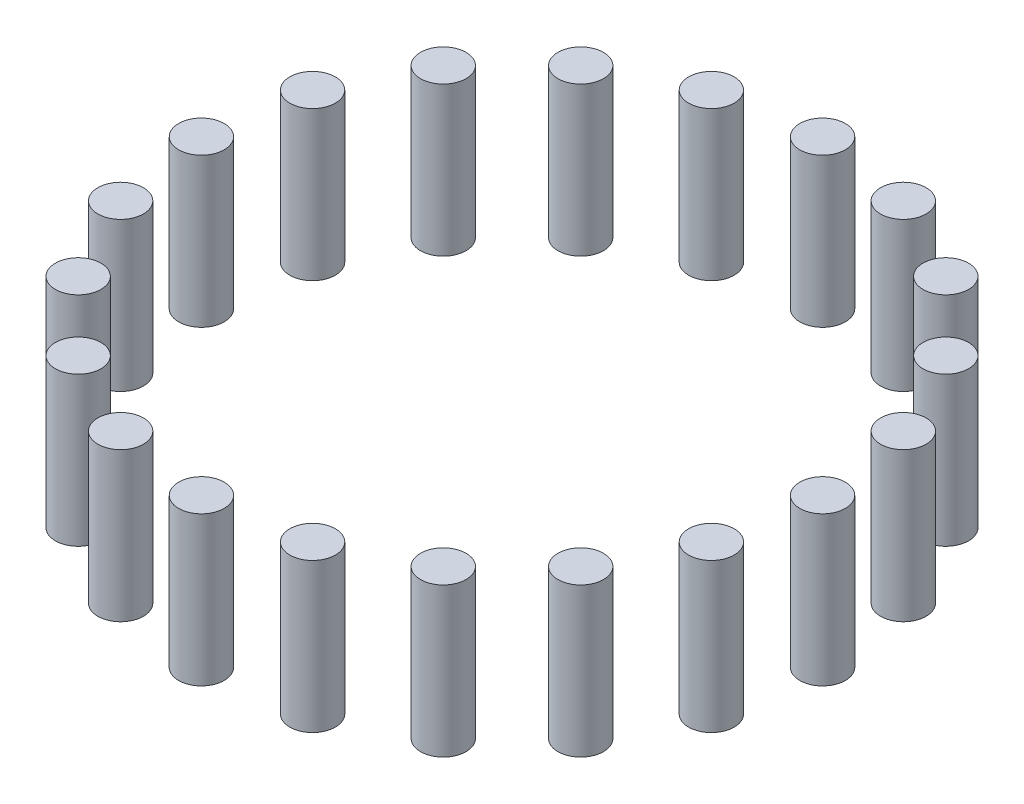
ISO-10303-21;
HEADER;
FILE_DESCRIPTION(('STEP AP214'),'2;1');
FILE_NAME('part.step','',(''),(''),'','','');
FILE_SCHEMA(('AUTOMOTIVE_DESIGN { 1 0 10303 214 1 1 1 1 }'));
ENDSEC;
DATA;
#1=APPLICATION_CONTEXT('core data for automotive mechanical design processes');
#2=APPLICATION_PROTOCOL_DEFINITION('international standard','automotive_design',2000,#1);
#3=PRODUCT_CONTEXT('',#1,'mechanical');
#4=PRODUCT('Part','Part','',(#3));
#5=PRODUCT_RELATED_PRODUCT_CATEGORY('part','',(#4));
#6=PRODUCT_DEFINITION_FORMATION('','',#4);
#7=PRODUCT_DEFINITION_CONTEXT('part definition',#1,'design');
#8=PRODUCT_DEFINITION('design','',#6,#7);
#9=PRODUCT_DEFINITION_SHAPE('','',#8);
#10=(LENGTH_UNIT() NAMED_UNIT(*) SI_UNIT(.MILLI.,.METRE.));
#11=(NAMED_UNIT(*) PLANE_ANGLE_UNIT() SI_UNIT($,.RADIAN.));
#12=(NAMED_UNIT(*) SI_UNIT($,.STERADIAN.) SOLID_ANGLE_UNIT());
#13=UNCERTAINTY_MEASURE_WITH_UNIT(LENGTH_MEASURE(1.E-05),#10,'distance_accuracy_value','');
#14=(GEOMETRIC_REPRESENTATION_CONTEXT(3) GLOBAL_UNCERTAINTY_ASSIGNED_CONTEXT((#13)) GLOBAL_UNIT_ASSIGNED_CONTEXT((#10,
#11,#12)) REPRESENTATION_CONTEXT('',''));
#15=CARTESIAN_POINT('',(0.,0.,0.));
#16=DIRECTION('',(0.,0.,1.));
#17=DIRECTION('',(1.,0.,0.));
#18=AXIS2_PLACEMENT_3D('',#15,#16,#17);
#19=CARTESIAN_POINT('',(23.1762745781199,36.,71.3292387221369));
#20=DIRECTION('',(0.,-1.,0.));
#21=DIRECTION('',(0.,0.,-1.));
#22=AXIS2_PLACEMENT_3D('',#19,#20,#21);
#23=CYLINDRICAL_SURFACE('',#22,5.50000000000001);
#24=CARTESIAN_POINT('',(23.1762745781199,36.,71.3292387221369));
#25=DIRECTION('',(0.,1.,0.));
#26=DIRECTION('',(0.,0.,1.));
#27=AXIS2_PLACEMENT_3D('',#24,#25,#26);
#28=CIRCLE('',#27,5.50000000000001);
#29=CARTESIAN_POINT('',(23.1762745781199,36.,76.8292387221369));
#30=VERTEX_POINT('',#29);
#31=EDGE_CURVE('E50',#30,#30,#28,.T.);
#32=ORIENTED_EDGE('',*,*,#31,.F.);
#33=EDGE_LOOP('',(#32));
#34=FACE_BOUND('',#33,.T.);
#35=CARTESIAN_POINT('',(23.1762745781199,0.,71.3292387221369));
#36=DIRECTION('',(0.,1.,0.));
#37=DIRECTION('',(0.,0.,1.));
#38=AXIS2_PLACEMENT_3D('',#35,#36,#37);
#39=CIRCLE('',#38,5.50000000000001);
#40=CARTESIAN_POINT('',(23.1762745781199,0.,76.8292387221369));
#41=VERTEX_POINT('',#40);
#42=EDGE_CURVE('E11',#41,#41,#39,.T.);
#43=ORIENTED_EDGE('',*,*,#42,.T.);
#44=EDGE_LOOP('',(#43));
#45=FACE_BOUND('',#44,.T.);
#46=ADVANCED_FACE('F46',(#34,#45),#23,.T.);
#47=CARTESIAN_POINT('',(23.1762745781199,36.,71.3292387221369));
#48=DIRECTION('',(0.,1.,0.));
#49=DIRECTION('',(0.,0.,1.));
#50=AXIS2_PLACEMENT_3D('',#47,#48,#49);
#51=PLANE('',#50);
#52=ORIENTED_EDGE('',*,*,#31,.T.);
#53=EDGE_LOOP('',(#52));
#54=FACE_BOUND('',#53,.T.);
#55=ADVANCED_FACE('F48',(#54),#51,.T.);
#56=CARTESIAN_POINT('',(23.1762745781199,0.,71.3292387221369));
#57=DIRECTION('',(0.,1.,0.));
#58=DIRECTION('',(0.,0.,1.));
#59=AXIS2_PLACEMENT_3D('',#56,#57,#58);
#60=PLANE('',#59);
#61=ORIENTED_EDGE('',*,*,#42,.F.);
#62=EDGE_LOOP('',(#61));
#63=FACE_BOUND('',#62,.T.);
#64=ADVANCED_FACE('F65',(#63),#60,.F.);
#65=CLOSED_SHELL('',(#46,#55,#64));
#66=MANIFOLD_SOLID_BREP('B2',#65);
#67=CARTESIAN_POINT('',(44.0838939219345,36.,60.6762745781218));
#68=DIRECTION('',(0.,-1.,0.));
#69=DIRECTION('',(0.,0.,-1.));
#70=AXIS2_PLACEMENT_3D('',#67,#68,#69);
#71=CYLINDRICAL_SURFACE('',#70,5.49999999999999);
#72=CARTESIAN_POINT('',(44.0838939219345,36.,60.6762745781218));
#73=DIRECTION('',(0.,1.,0.));
#74=DIRECTION('',(0.,0.,1.));
#75=AXIS2_PLACEMENT_3D('',#72,#73,#74);
#76=CIRCLE('',#75,5.49999999999999);
#77=CARTESIAN_POINT('',(44.0838939219345,36.,66.1762745781218));
#78=VERTEX_POINT('',#77);
#79=EDGE_CURVE('E105',#78,#78,#76,.T.);
#80=ORIENTED_EDGE('',*,*,#79,.F.);
#81=EDGE_LOOP('',(#80));
#82=FACE_BOUND('',#81,.T.);
#83=CARTESIAN_POINT('',(44.0838939219345,0.,60.6762745781218));
#84=DIRECTION('',(0.,1.,0.));
#85=DIRECTION('',(0.,0.,1.));
#86=AXIS2_PLACEMENT_3D('',#83,#84,#85);
#87=CIRCLE('',#86,5.49999999999999);
#88=CARTESIAN_POINT('',(44.0838939219345,0.,66.1762745781218));
#89=VERTEX_POINT('',#88);
#90=EDGE_CURVE('E45',#89,#89,#87,.T.);
#91=ORIENTED_EDGE('',*,*,#90,.T.);
#92=EDGE_LOOP('',(#91));
#93=FACE_BOUND('',#92,.T.);
#94=ADVANCED_FACE('F101',(#82,#93),#71,.T.);
#95=CARTESIAN_POINT('',(44.0838939219345,36.,60.6762745781218));
#96=DIRECTION('',(0.,1.,0.));
#97=DIRECTION('',(0.,0.,1.));
#98=AXIS2_PLACEMENT_3D('',#95,#96,#97);
#99=PLANE('',#98);
#100=ORIENTED_EDGE('',*,*,#79,.T.);
#101=EDGE_LOOP('',(#100));
#102=FACE_BOUND('',#101,.T.);
#103=ADVANCED_FACE('F103',(#102),#99,.T.);
#104=CARTESIAN_POINT('',(44.0838939219345,0.,60.6762745781218));
#105=DIRECTION('',(0.,1.,0.));
#106=DIRECTION('',(0.,0.,1.));
#107=AXIS2_PLACEMENT_3D('',#104,#105,#106);
#108=PLANE('',#107);
#109=ORIENTED_EDGE('',*,*,#90,.F.);
#110=EDGE_LOOP('',(#109));
#111=FACE_BOUND('',#110,.T.);
#112=ADVANCED_FACE('F120',(#111),#108,.F.);
#113=CLOSED_SHELL('',(#94,#103,#112));
#114=MANIFOLD_SOLID_BREP('B6',#113);
#115=CARTESIAN_POINT('',(60.6762745781204,36.,44.0838939219364));
#116=DIRECTION('',(0.,-1.,0.));
#117=DIRECTION('',(0.,0.,-1.));
#118=AXIS2_PLACEMENT_3D('',#115,#116,#117);
#119=CYLINDRICAL_SURFACE('',#118,5.50000000000001);
#120=CARTESIAN_POINT('',(60.6762745781204,36.,44.0838939219364));
#121=DIRECTION('',(0.,1.,0.));
#122=DIRECTION('',(0.,0.,1.));
#123=AXIS2_PLACEMENT_3D('',#120,#121,#122);
#124=CIRCLE('',#123,5.50000000000001);
#125=CARTESIAN_POINT('',(60.6762745781204,36.,49.5838939219364));
#126=VERTEX_POINT('',#125);
#127=EDGE_CURVE('E160',#126,#126,#124,.T.);
#128=ORIENTED_EDGE('',*,*,#127,.F.);
#129=EDGE_LOOP('',(#128));
#130=FACE_BOUND('',#129,.T.);
#131=CARTESIAN_POINT('',(60.6762745781204,0.,44.0838939219364));
#132=DIRECTION('',(0.,1.,0.));
#133=DIRECTION('',(0.,0.,1.));
#134=AXIS2_PLACEMENT_3D('',#131,#132,#133);
#135=CIRCLE('',#134,5.50000000000001);
#136=CARTESIAN_POINT('',(60.6762745781204,0.,49.5838939219364));
#137=VERTEX_POINT('',#136);
#138=EDGE_CURVE('E100',#137,#137,#135,.T.);
#139=ORIENTED_EDGE('',*,*,#138,.T.);
#140=EDGE_LOOP('',(#139));
#141=FACE_BOUND('',#140,.T.);
#142=ADVANCED_FACE('F156',(#130,#141),#119,.T.);
#143=CARTESIAN_POINT('',(60.6762745781204,36.,44.0838939219364));
#144=DIRECTION('',(0.,1.,0.));
#145=DIRECTION('',(0.,0.,1.));
#146=AXIS2_PLACEMENT_3D('',#143,#144,#145);
#147=PLANE('',#146);
#148=ORIENTED_EDGE('',*,*,#127,.T.);
#149=EDGE_LOOP('',(#148));
#150=FACE_BOUND('',#149,.T.);
#151=ADVANCED_FACE('F158',(#150),#147,.T.);
#152=CARTESIAN_POINT('',(60.6762745781204,0.,44.0838939219364));
#153=DIRECTION('',(0.,1.,0.));
#154=DIRECTION('',(0.,0.,1.));
#155=AXIS2_PLACEMENT_3D('',#152,#153,#154);
#156=PLANE('',#155);
#157=ORIENTED_EDGE('',*,*,#138,.F.);
#158=EDGE_LOOP('',(#157));
#159=FACE_BOUND('',#158,.T.);
#160=ADVANCED_FACE('F175',(#159),#156,.F.);
#161=CLOSED_SHELL('',(#142,#151,#160));
#162=MANIFOLD_SOLID_BREP('B40',#161);
#163=CARTESIAN_POINT('',(71.3292387221362,36.,23.1762745781221));
#164=DIRECTION('',(0.,-1.,0.));
#165=DIRECTION('',(0.,0.,-1.));
#166=AXIS2_PLACEMENT_3D('',#163,#164,#165);
#167=CYLINDRICAL_SURFACE('',#166,5.50000000000001);
#168=CARTESIAN_POINT('',(71.3292387221362,36.,23.1762745781221));
#169=DIRECTION('',(0.,1.,0.));
#170=DIRECTION('',(0.,0.,1.));
#171=AXIS2_PLACEMENT_3D('',#168,#169,#170);
#172=CIRCLE('',#171,5.50000000000001);
#173=CARTESIAN_POINT('',(71.3292387221362,36.,28.6762745781221));
#174=VERTEX_POINT('',#173);
#175=EDGE_CURVE('E215',#174,#174,#172,.T.);
#176=ORIENTED_EDGE('',*,*,#175,.F.);
#177=EDGE_LOOP('',(#176));
#178=FACE_BOUND('',#177,.T.);
#179=CARTESIAN_POINT('',(71.3292387221362,0.,23.1762745781221));
#180=DIRECTION('',(0.,1.,0.));
#181=DIRECTION('',(0.,0.,1.));
#182=AXIS2_PLACEMENT_3D('',#179,#180,#181);
#183=CIRCLE('',#182,5.50000000000001);
#184=CARTESIAN_POINT('',(71.3292387221362,0.,28.6762745781221));
#185=VERTEX_POINT('',#184);
#186=EDGE_CURVE('E155',#185,#185,#183,.T.);
#187=ORIENTED_EDGE('',*,*,#186,.T.);
#188=EDGE_LOOP('',(#187));
#189=FACE_BOUND('',#188,.T.);
#190=ADVANCED_FACE('F211',(#178,#189),#167,.T.);
#191=CARTESIAN_POINT('',(71.3292387221362,36.,23.1762745781221));
#192=DIRECTION('',(0.,1.,0.));
#193=DIRECTION('',(0.,0.,1.));
#194=AXIS2_PLACEMENT_3D('',#191,#192,#193);
#195=PLANE('',#194);
#196=ORIENTED_EDGE('',*,*,#175,.T.);
#197=EDGE_LOOP('',(#196));
#198=FACE_BOUND('',#197,.T.);
#199=ADVANCED_FACE('F213',(#198),#195,.T.);
#200=CARTESIAN_POINT('',(71.3292387221362,0.,23.1762745781221));
#201=DIRECTION('',(0.,1.,0.));
#202=DIRECTION('',(0.,0.,1.));
#203=AXIS2_PLACEMENT_3D('',#200,#201,#202);
#204=PLANE('',#203);
#205=ORIENTED_EDGE('',*,*,#186,.F.);
#206=EDGE_LOOP('',(#205));
#207=FACE_BOUND('',#206,.T.);
#208=ADVANCED_FACE('F230',(#207),#204,.F.);
#209=CLOSED_SHELL('',(#190,#199,#208));
#210=MANIFOLD_SOLID_BREP('B95',#209);
#211=CARTESIAN_POINT('',(75.,36.,0.));
#212=DIRECTION('',(0.,-1.,0.));
#213=DIRECTION('',(0.,0.,-1.));
#214=AXIS2_PLACEMENT_3D('',#211,#212,#213);
#215=CYLINDRICAL_SURFACE('',#214,5.5);
#216=CARTESIAN_POINT('',(75.,36.,0.));
#217=DIRECTION('',(0.,1.,0.));
#218=DIRECTION('',(0.,0.,1.));
#219=AXIS2_PLACEMENT_3D('',#216,#217,#218);
#220=CIRCLE('',#219,5.5);
#221=CARTESIAN_POINT('',(75.,36.,5.5));
#222=VERTEX_POINT('',#221);
#223=EDGE_CURVE('E270',#222,#222,#220,.T.);
#224=ORIENTED_EDGE('',*,*,#223,.F.);
#225=EDGE_LOOP('',(#224));
#226=FACE_BOUND('',#225,.T.);
#227=CARTESIAN_POINT('',(75.,0.,0.));
#228=DIRECTION('',(0.,1.,0.));
#229=DIRECTION('',(0.,0.,1.));
#230=AXIS2_PLACEMENT_3D('',#227,#228,#229);
#231=CIRCLE('',#230,5.5);
#232=CARTESIAN_POINT('',(75.,0.,5.5));
#233=VERTEX_POINT('',#232);
#234=EDGE_CURVE('E210',#233,#233,#231,.T.);
#235=ORIENTED_EDGE('',*,*,#234,.T.);
#236=EDGE_LOOP('',(#235));
#237=FACE_BOUND('',#236,.T.);
#238=ADVANCED_FACE('F266',(#226,#237),#215,.T.);
#239=CARTESIAN_POINT('',(75.,36.,0.));
#240=DIRECTION('',(0.,1.,0.));
#241=DIRECTION('',(0.,0.,1.));
#242=AXIS2_PLACEMENT_3D('',#239,#240,#241);
#243=PLANE('',#242);
#244=ORIENTED_EDGE('',*,*,#223,.T.);
#245=EDGE_LOOP('',(#244));
#246=FACE_BOUND('',#245,.T.);
#247=ADVANCED_FACE('F268',(#246),#243,.T.);
#248=CARTESIAN_POINT('',(75.,0.,0.));
#249=DIRECTION('',(0.,1.,0.));
#250=DIRECTION('',(0.,0.,1.));
#251=AXIS2_PLACEMENT_3D('',#248,#249,#250);
#252=PLANE('',#251);
#253=ORIENTED_EDGE('',*,*,#234,.F.);
#254=EDGE_LOOP('',(#253));
#255=FACE_BOUND('',#254,.T.);
#256=ADVANCED_FACE('F285',(#255),#252,.F.);
#257=CLOSED_SHELL('',(#238,#247,#256));
#258=MANIFOLD_SOLID_BREP('B150',#257);
#259=CARTESIAN_POINT('',(-1.33486971476415E-12,36.,75.));
#260=DIRECTION('',(0.,-1.,0.));
#261=DIRECTION('',(0.,0.,-1.));
#262=AXIS2_PLACEMENT_3D('',#259,#260,#261);
#263=CYLINDRICAL_SURFACE('',#262,5.50000000000002);
#264=CARTESIAN_POINT('',(-1.33486971476415E-12,36.,75.));
#265=DIRECTION('',(0.,1.,0.));
#266=DIRECTION('',(0.,0.,1.));
#267=AXIS2_PLACEMENT_3D('',#264,#265,#266);
#268=CIRCLE('',#267,5.50000000000002);
#269=CARTESIAN_POINT('',(-1.33486971476415E-12,36.,80.5));
#270=VERTEX_POINT('',#269);
#271=EDGE_CURVE('E325',#270,#270,#268,.T.);
#272=ORIENTED_EDGE('',*,*,#271,.F.);
#273=EDGE_LOOP('',(#272));
#274=FACE_BOUND('',#273,.T.);
#275=CARTESIAN_POINT('',(-1.33486971476415E-12,0.,75.));
#276=DIRECTION('',(0.,1.,0.));
#277=DIRECTION('',(0.,0.,1.));
#278=AXIS2_PLACEMENT_3D('',#275,#276,#277);
#279=CIRCLE('',#278,5.50000000000002);
#280=CARTESIAN_POINT('',(-1.33486971476415E-12,0.,80.5));
#281=VERTEX_POINT('',#280);
#282=EDGE_CURVE('E265',#281,#281,#279,.T.);
#283=ORIENTED_EDGE('',*,*,#282,.T.);
#284=EDGE_LOOP('',(#283));
#285=FACE_BOUND('',#284,.T.);
#286=ADVANCED_FACE('F321',(#274,#285),#263,.T.);
#287=CARTESIAN_POINT('',(-1.33486971476415E-12,36.,75.));
#288=DIRECTION('',(0.,1.,0.));
#289=DIRECTION('',(0.,0.,1.));
#290=AXIS2_PLACEMENT_3D('',#287,#288,#289);
#291=PLANE('',#290);
#292=ORIENTED_EDGE('',*,*,#271,.T.);
#293=EDGE_LOOP('',(#292));
#294=FACE_BOUND('',#293,.T.);
#295=ADVANCED_FACE('F323',(#294),#291,.T.);
#296=CARTESIAN_POINT('',(-1.33486971476415E-12,0.,75.));
#297=DIRECTION('',(0.,1.,0.));
#298=DIRECTION('',(0.,0.,1.));
#299=AXIS2_PLACEMENT_3D('',#296,#297,#298);
#300=PLANE('',#299);
#301=ORIENTED_EDGE('',*,*,#282,.F.);
#302=EDGE_LOOP('',(#301));
#303=FACE_BOUND('',#302,.T.);
#304=ADVANCED_FACE('F340',(#303),#300,.F.);
#305=CLOSED_SHELL('',(#286,#295,#304));
#306=MANIFOLD_SOLID_BREP('B205',#305);
#307=CARTESIAN_POINT('',(-23.1762745781224,36.,71.3292387221361));
#308=DIRECTION('',(0.,-1.,0.));
#309=DIRECTION('',(0.,0.,-1.));
#310=AXIS2_PLACEMENT_3D('',#307,#308,#309);
#311=CYLINDRICAL_SURFACE('',#310,5.50000000000002);
#312=CARTESIAN_POINT('',(-23.1762745781224,36.,71.3292387221361));
#313=DIRECTION('',(0.,1.,0.));
#314=DIRECTION('',(0.,0.,1.));
#315=AXIS2_PLACEMENT_3D('',#312,#313,#314);
#316=CIRCLE('',#315,5.50000000000002);
#317=CARTESIAN_POINT('',(-23.1762745781224,36.,76.8292387221361));
#318=VERTEX_POINT('',#317);
#319=EDGE_CURVE('E380',#318,#318,#316,.T.);
#320=ORIENTED_EDGE('',*,*,#319,.F.);
#321=EDGE_LOOP('',(#320));
#322=FACE_BOUND('',#321,.T.);
#323=CARTESIAN_POINT('',(-23.1762745781224,0.,71.3292387221361));
#324=DIRECTION('',(0.,1.,0.));
#325=DIRECTION('',(0.,0.,1.));
#326=AXIS2_PLACEMENT_3D('',#323,#324,#325);
#327=CIRCLE('',#326,5.50000000000002);
#328=CARTESIAN_POINT('',(-23.1762745781224,0.,76.8292387221361));
#329=VERTEX_POINT('',#328);
#330=EDGE_CURVE('E320',#329,#329,#327,.T.);
#331=ORIENTED_EDGE('',*,*,#330,.T.);
#332=EDGE_LOOP('',(#331));
#333=FACE_BOUND('',#332,.T.);
#334=ADVANCED_FACE('F376',(#322,#333),#311,.T.);
#335=CARTESIAN_POINT('',(-23.1762745781224,36.,71.3292387221361));
#336=DIRECTION('',(0.,1.,0.));
#337=DIRECTION('',(0.,0.,1.));
#338=AXIS2_PLACEMENT_3D('',#335,#336,#337);
#339=PLANE('',#338);
#340=ORIENTED_EDGE('',*,*,#319,.T.);
#341=EDGE_LOOP('',(#340));
#342=FACE_BOUND('',#341,.T.);
#343=ADVANCED_FACE('F378',(#342),#339,.T.);
#344=CARTESIAN_POINT('',(-23.1762745781224,0.,71.3292387221361));
#345=DIRECTION('',(0.,1.,0.));
#346=DIRECTION('',(0.,0.,1.));
#347=AXIS2_PLACEMENT_3D('',#344,#345,#346);
#348=PLANE('',#347);
#349=ORIENTED_EDGE('',*,*,#330,.F.);
#350=EDGE_LOOP('',(#349));
#351=FACE_BOUND('',#350,.T.);
#352=ADVANCED_FACE('F395',(#351),#348,.F.);
#353=CLOSED_SHELL('',(#334,#343,#352));
#354=MANIFOLD_SOLID_BREP('B260',#353);
#355=CARTESIAN_POINT('',(-44.0838939219366,36.,60.6762745781202));
#356=DIRECTION('',(0.,-1.,0.));
#357=DIRECTION('',(0.,0.,-1.));
#358=AXIS2_PLACEMENT_3D('',#355,#356,#357);
#359=CYLINDRICAL_SURFACE('',#358,5.50000000000001);
#360=CARTESIAN_POINT('',(-44.0838939219366,36.,60.6762745781202));
#361=DIRECTION('',(0.,1.,0.));
#362=DIRECTION('',(0.,0.,1.));
#363=AXIS2_PLACEMENT_3D('',#360,#361,#362);
#364=CIRCLE('',#363,5.50000000000001);
#365=CARTESIAN_POINT('',(-44.0838939219366,36.,66.1762745781202));
#366=VERTEX_POINT('',#365);
#367=EDGE_CURVE('E435',#366,#366,#364,.T.);
#368=ORIENTED_EDGE('',*,*,#367,.F.);
#369=EDGE_LOOP('',(#368));
#370=FACE_BOUND('',#369,.T.);
#371=CARTESIAN_POINT('',(-44.0838939219366,0.,60.6762745781202));
#372=DIRECTION('',(0.,1.,0.));
#373=DIRECTION('',(0.,0.,1.));
#374=AXIS2_PLACEMENT_3D('',#371,#372,#373);
#375=CIRCLE('',#374,5.50000000000001);
#376=CARTESIAN_POINT('',(-44.0838939219366,0.,66.1762745781202));
#377=VERTEX_POINT('',#376);
#378=EDGE_CURVE('E375',#377,#377,#375,.T.);
#379=ORIENTED_EDGE('',*,*,#378,.T.);
#380=EDGE_LOOP('',(#379));
#381=FACE_BOUND('',#380,.T.);
#382=ADVANCED_FACE('F431',(#370,#381),#359,.T.);
#383=CARTESIAN_POINT('',(-44.0838939219366,36.,60.6762745781202));
#384=DIRECTION('',(0.,1.,0.));
#385=DIRECTION('',(0.,0.,1.));
#386=AXIS2_PLACEMENT_3D('',#383,#384,#385);
#387=PLANE('',#386);
#388=ORIENTED_EDGE('',*,*,#367,.T.);
#389=EDGE_LOOP('',(#388));
#390=FACE_BOUND('',#389,.T.);
#391=ADVANCED_FACE('F433',(#390),#387,.T.);
#392=CARTESIAN_POINT('',(-44.0838939219366,0.,60.6762745781202));
#393=DIRECTION('',(0.,1.,0.));
#394=DIRECTION('',(0.,0.,1.));
#395=AXIS2_PLACEMENT_3D('',#392,#393,#394);
#396=PLANE('',#395);
#397=ORIENTED_EDGE('',*,*,#378,.F.);
#398=EDGE_LOOP('',(#397));
#399=FACE_BOUND('',#398,.T.);
#400=ADVANCED_FACE('F450',(#399),#396,.F.);
#401=CLOSED_SHELL('',(#382,#391,#400));
#402=MANIFOLD_SOLID_BREP('B315',#401);
#403=CARTESIAN_POINT('',(-60.676274578122,36.,44.0838939219343));
#404=DIRECTION('',(0.,-1.,0.));
#405=DIRECTION('',(0.,0.,-1.));
#406=AXIS2_PLACEMENT_3D('',#403,#404,#405);
#407=CYLINDRICAL_SURFACE('',#406,5.50000000000001);
#408=CARTESIAN_POINT('',(-60.676274578122,36.,44.0838939219343));
#409=DIRECTION('',(0.,1.,0.));
#410=DIRECTION('',(0.,0.,1.));
#411=AXIS2_PLACEMENT_3D('',#408,#409,#410);
#412=CIRCLE('',#411,5.50000000000001);
#413=CARTESIAN_POINT('',(-60.676274578122,36.,49.5838939219343));
#414=VERTEX_POINT('',#413);
#415=EDGE_CURVE('E490',#414,#414,#412,.T.);
#416=ORIENTED_EDGE('',*,*,#415,.F.);
#417=EDGE_LOOP('',(#416));
#418=FACE_BOUND('',#417,.T.);
#419=CARTESIAN_POINT('',(-60.676274578122,0.,44.0838939219343));
#420=DIRECTION('',(0.,1.,0.));
#421=DIRECTION('',(0.,0.,1.));
#422=AXIS2_PLACEMENT_3D('',#419,#420,#421);
#423=CIRCLE('',#422,5.50000000000001);
#424=CARTESIAN_POINT('',(-60.676274578122,0.,49.5838939219343));
#425=VERTEX_POINT('',#424);
#426=EDGE_CURVE('E430',#425,#425,#423,.T.);
#427=ORIENTED_EDGE('',*,*,#426,.T.);
#428=EDGE_LOOP('',(#427));
#429=FACE_BOUND('',#428,.T.);
#430=ADVANCED_FACE('F486',(#418,#429),#407,.T.);
#431=CARTESIAN_POINT('',(-60.676274578122,36.,44.0838939219343));
#432=DIRECTION('',(0.,1.,0.));
#433=DIRECTION('',(0.,0.,1.));
#434=AXIS2_PLACEMENT_3D('',#431,#432,#433);
#435=PLANE('',#434);
#436=ORIENTED_EDGE('',*,*,#415,.T.);
#437=EDGE_LOOP('',(#436));
#438=FACE_BOUND('',#437,.T.);
#439=ADVANCED_FACE('F488',(#438),#435,.T.);
#440=CARTESIAN_POINT('',(-60.676274578122,0.,44.0838939219343));
#441=DIRECTION('',(0.,1.,0.));
#442=DIRECTION('',(0.,0.,1.));
#443=AXIS2_PLACEMENT_3D('',#440,#441,#442);
#444=PLANE('',#443);
#445=ORIENTED_EDGE('',*,*,#426,.F.);
#446=EDGE_LOOP('',(#445));
#447=FACE_BOUND('',#446,.T.);
#448=ADVANCED_FACE('F505',(#447),#444,.F.);
#449=CLOSED_SHELL('',(#430,#439,#448));
#450=MANIFOLD_SOLID_BREP('B370',#449);
#451=CARTESIAN_POINT('',(-71.329238722137,36.,23.1762745781196));
#452=DIRECTION('',(0.,-1.,0.));
#453=DIRECTION('',(0.,0.,-1.));
#454=AXIS2_PLACEMENT_3D('',#451,#452,#453);
#455=CYLINDRICAL_SURFACE('',#454,5.50000000000001);
#456=CARTESIAN_POINT('',(-71.329238722137,36.,23.1762745781196));
#457=DIRECTION('',(0.,1.,0.));
#458=DIRECTION('',(0.,0.,1.));
#459=AXIS2_PLACEMENT_3D('',#456,#457,#458);
#460=CIRCLE('',#459,5.50000000000001);
#461=CARTESIAN_POINT('',(-71.329238722137,36.,28.6762745781196));
#462=VERTEX_POINT('',#461);
#463=EDGE_CURVE('E545',#462,#462,#460,.T.);
#464=ORIENTED_EDGE('',*,*,#463,.F.);
#465=EDGE_LOOP('',(#464));
#466=FACE_BOUND('',#465,.T.);
#467=CARTESIAN_POINT('',(-71.329238722137,0.,23.1762745781196));
#468=DIRECTION('',(0.,1.,0.));
#469=DIRECTION('',(0.,0.,1.));
#470=AXIS2_PLACEMENT_3D('',#467,#468,#469);
#471=CIRCLE('',#470,5.50000000000001);
#472=CARTESIAN_POINT('',(-71.329238722137,0.,28.6762745781196));
#473=VERTEX_POINT('',#472);
#474=EDGE_CURVE('E485',#473,#473,#471,.T.);
#475=ORIENTED_EDGE('',*,*,#474,.T.);
#476=EDGE_LOOP('',(#475));
#477=FACE_BOUND('',#476,.T.);
#478=ADVANCED_FACE('F541',(#466,#477),#455,.T.);
#479=CARTESIAN_POINT('',(-71.329238722137,36.,23.1762745781196));
#480=DIRECTION('',(0.,1.,0.));
#481=DIRECTION('',(0.,0.,1.));
#482=AXIS2_PLACEMENT_3D('',#479,#480,#481);
#483=PLANE('',#482);
#484=ORIENTED_EDGE('',*,*,#463,.T.);
#485=EDGE_LOOP('',(#484));
#486=FACE_BOUND('',#485,.T.);
#487=ADVANCED_FACE('F543',(#486),#483,.T.);
#488=CARTESIAN_POINT('',(-71.329238722137,0.,23.1762745781196));
#489=DIRECTION('',(0.,1.,0.));
#490=DIRECTION('',(0.,0.,1.));
#491=AXIS2_PLACEMENT_3D('',#488,#489,#490);
#492=PLANE('',#491);
#493=ORIENTED_EDGE('',*,*,#474,.F.);
#494=EDGE_LOOP('',(#493));
#495=FACE_BOUND('',#494,.T.);
#496=ADVANCED_FACE('F560',(#495),#492,.F.);
#497=CLOSED_SHELL('',(#478,#487,#496));
#498=MANIFOLD_SOLID_BREP('B425',#497);
#499=CARTESIAN_POINT('',(-75.0000000000001,36.,-1.58033308661487E-12));
#500=DIRECTION('',(0.,-1.,0.));
#501=DIRECTION('',(0.,0.,-1.));
#502=AXIS2_PLACEMENT_3D('',#499,#500,#501);
#503=CYLINDRICAL_SURFACE('',#502,5.5);
#504=CARTESIAN_POINT('',(-75.0000000000001,36.,-1.58033308661487E-12));
#505=DIRECTION('',(0.,1.,0.));
#506=DIRECTION('',(0.,0.,1.));
#507=AXIS2_PLACEMENT_3D('',#504,#505,#506);
#508=CIRCLE('',#507,5.5);
#509=CARTESIAN_POINT('',(-75.0000000000001,36.,5.49999999999842));
#510=VERTEX_POINT('',#509);
#511=EDGE_CURVE('E600',#510,#510,#508,.T.);
#512=ORIENTED_EDGE('',*,*,#511,.F.);
#513=EDGE_LOOP('',(#512));
#514=FACE_BOUND('',#513,.T.);
#515=CARTESIAN_POINT('',(-75.0000000000001,0.,-1.58033308661487E-12));
#516=DIRECTION('',(0.,1.,0.));
#517=DIRECTION('',(0.,0.,1.));
#518=AXIS2_PLACEMENT_3D('',#515,#516,#517);
#519=CIRCLE('',#518,5.5);
#520=CARTESIAN_POINT('',(-75.0000000000001,0.,5.49999999999842));
#521=VERTEX_POINT('',#520);
#522=EDGE_CURVE('E540',#521,#521,#519,.T.);
#523=ORIENTED_EDGE('',*,*,#522,.T.);
#524=EDGE_LOOP('',(#523));
#525=FACE_BOUND('',#524,.T.);
#526=ADVANCED_FACE('F596',(#514,#525),#503,.T.);
#527=CARTESIAN_POINT('',(-75.0000000000001,36.,-1.58033308661487E-12));
#528=DIRECTION('',(0.,1.,0.));
#529=DIRECTION('',(0.,0.,1.));
#530=AXIS2_PLACEMENT_3D('',#527,#528,#529);
#531=PLANE('',#530);
#532=ORIENTED_EDGE('',*,*,#511,.T.);
#533=EDGE_LOOP('',(#532));
#534=FACE_BOUND('',#533,.T.);
#535=ADVANCED_FACE('F598',(#534),#531,.T.);
#536=CARTESIAN_POINT('',(-75.0000000000001,0.,-1.58033308661487E-12));
#537=DIRECTION('',(0.,1.,0.));
#538=DIRECTION('',(0.,0.,1.));
#539=AXIS2_PLACEMENT_3D('',#536,#537,#538);
#540=PLANE('',#539);
#541=ORIENTED_EDGE('',*,*,#522,.F.);
#542=EDGE_LOOP('',(#541));
#543=FACE_BOUND('',#542,.T.);
#544=ADVANCED_FACE('F615',(#543),#540,.F.);
#545=CLOSED_SHELL('',(#526,#535,#544));
#546=MANIFOLD_SOLID_BREP('B480',#545);
#547=CARTESIAN_POINT('',(-71.3292387221363,36.,-23.1762745781216));
#548=DIRECTION('',(0.,-1.,0.));
#549=DIRECTION('',(0.,0.,-1.));
#550=AXIS2_PLACEMENT_3D('',#547,#548,#549);
#551=CYLINDRICAL_SURFACE('',#550,5.50000000000001);
#552=CARTESIAN_POINT('',(-71.3292387221363,36.,-23.1762745781216));
#553=DIRECTION('',(0.,1.,0.));
#554=DIRECTION('',(0.,0.,1.));
#555=AXIS2_PLACEMENT_3D('',#552,#553,#554);
#556=CIRCLE('',#555,5.50000000000001);
#557=CARTESIAN_POINT('',(-71.3292387221363,36.,-17.6762745781216));
#558=VERTEX_POINT('',#557);
#559=EDGE_CURVE('E655',#558,#558,#556,.T.);
#560=ORIENTED_EDGE('',*,*,#559,.F.);
#561=EDGE_LOOP('',(#560));
#562=FACE_BOUND('',#561,.T.);
#563=CARTESIAN_POINT('',(-71.3292387221363,0.,-23.1762745781216));
#564=DIRECTION('',(0.,1.,0.));
#565=DIRECTION('',(0.,0.,1.));
#566=AXIS2_PLACEMENT_3D('',#563,#564,#565);
#567=CIRCLE('',#566,5.50000000000001);
#568=CARTESIAN_POINT('',(-71.3292387221363,0.,-17.6762745781216));
#569=VERTEX_POINT('',#568);
#570=EDGE_CURVE('E595',#569,#569,#567,.T.);
#571=ORIENTED_EDGE('',*,*,#570,.T.);
#572=EDGE_LOOP('',(#571));
#573=FACE_BOUND('',#572,.T.);
#574=ADVANCED_FACE('F651',(#562,#573),#551,.T.);
#575=CARTESIAN_POINT('',(-71.3292387221363,36.,-23.1762745781216));
#576=DIRECTION('',(0.,1.,0.));
#577=DIRECTION('',(0.,0.,1.));
#578=AXIS2_PLACEMENT_3D('',#575,#576,#577);
#579=PLANE('',#578);
#580=ORIENTED_EDGE('',*,*,#559,.T.);
#581=EDGE_LOOP('',(#580));
#582=FACE_BOUND('',#581,.T.);
#583=ADVANCED_FACE('F653',(#582),#579,.T.);
#584=CARTESIAN_POINT('',(-71.3292387221363,0.,-23.1762745781216));
#585=DIRECTION('',(0.,1.,0.));
#586=DIRECTION('',(0.,0.,1.));
#587=AXIS2_PLACEMENT_3D('',#584,#585,#586);
#588=PLANE('',#587);
#589=ORIENTED_EDGE('',*,*,#570,.F.);
#590=EDGE_LOOP('',(#589));
#591=FACE_BOUND('',#590,.T.);
#592=ADVANCED_FACE('F670',(#591),#588,.F.);
#593=CLOSED_SHELL('',(#574,#583,#592));
#594=MANIFOLD_SOLID_BREP('B535',#593);
#595=CARTESIAN_POINT('',(-60.6762745781207,36.,-44.083893921936));
#596=DIRECTION('',(0.,-1.,0.));
#597=DIRECTION('',(0.,0.,-1.));
#598=AXIS2_PLACEMENT_3D('',#595,#596,#597);
#599=CYLINDRICAL_SURFACE('',#598,5.50000000000002);
#600=CARTESIAN_POINT('',(-60.6762745781207,36.,-44.083893921936));
#601=DIRECTION('',(0.,1.,0.));
#602=DIRECTION('',(0.,0.,1.));
#603=AXIS2_PLACEMENT_3D('',#600,#601,#602);
#604=CIRCLE('',#603,5.50000000000002);
#605=CARTESIAN_POINT('',(-60.6762745781207,36.,-38.583893921936));
#606=VERTEX_POINT('',#605);
#607=EDGE_CURVE('E710',#606,#606,#604,.T.);
#608=ORIENTED_EDGE('',*,*,#607,.F.);
#609=EDGE_LOOP('',(#608));
#610=FACE_BOUND('',#609,.T.);
#611=CARTESIAN_POINT('',(-60.6762745781207,0.,-44.083893921936));
#612=DIRECTION('',(0.,1.,0.));
#613=DIRECTION('',(0.,0.,1.));
#614=AXIS2_PLACEMENT_3D('',#611,#612,#613);
#615=CIRCLE('',#614,5.50000000000002);
#616=CARTESIAN_POINT('',(-60.6762745781207,0.,-38.583893921936));
#617=VERTEX_POINT('',#616);
#618=EDGE_CURVE('E650',#617,#617,#615,.T.);
#619=ORIENTED_EDGE('',*,*,#618,.T.);
#620=EDGE_LOOP('',(#619));
#621=FACE_BOUND('',#620,.T.);
#622=ADVANCED_FACE('F706',(#610,#621),#599,.T.);
#623=CARTESIAN_POINT('',(-60.6762745781207,36.,-44.083893921936));
#624=DIRECTION('',(0.,1.,0.));
#625=DIRECTION('',(0.,0.,1.));
#626=AXIS2_PLACEMENT_3D('',#623,#624,#625);
#627=PLANE('',#626);
#628=ORIENTED_EDGE('',*,*,#607,.T.);
#629=EDGE_LOOP('',(#628));
#630=FACE_BOUND('',#629,.T.);
#631=ADVANCED_FACE('F708',(#630),#627,.T.);
#632=CARTESIAN_POINT('',(-60.6762745781207,0.,-44.083893921936));
#633=DIRECTION('',(0.,1.,0.));
#634=DIRECTION('',(0.,0.,1.));
#635=AXIS2_PLACEMENT_3D('',#632,#633,#634);
#636=PLANE('',#635);
#637=ORIENTED_EDGE('',*,*,#618,.F.);
#638=EDGE_LOOP('',(#637));
#639=FACE_BOUND('',#638,.T.);
#640=ADVANCED_FACE('F725',(#639),#636,.F.);
#641=CLOSED_SHELL('',(#622,#631,#640));
#642=MANIFOLD_SOLID_BREP('B590',#641);
#643=CARTESIAN_POINT('',(-44.0838939219349,36.,-60.6762745781215));
#644=DIRECTION('',(0.,-1.,0.));
#645=DIRECTION('',(0.,0.,-1.));
#646=AXIS2_PLACEMENT_3D('',#643,#644,#645);
#647=CYLINDRICAL_SURFACE('',#646,5.50000000000001);
#648=CARTESIAN_POINT('',(-44.0838939219349,36.,-60.6762745781215));
#649=DIRECTION('',(0.,1.,0.));
#650=DIRECTION('',(0.,0.,1.));
#651=AXIS2_PLACEMENT_3D('',#648,#649,#650);
#652=CIRCLE('',#651,5.50000000000001);
#653=CARTESIAN_POINT('',(-44.0838939219349,36.,-55.1762745781215));
#654=VERTEX_POINT('',#653);
#655=EDGE_CURVE('E765',#654,#654,#652,.T.);
#656=ORIENTED_EDGE('',*,*,#655,.F.);
#657=EDGE_LOOP('',(#656));
#658=FACE_BOUND('',#657,.T.);
#659=CARTESIAN_POINT('',(-44.0838939219349,0.,-60.6762745781215));
#660=DIRECTION('',(0.,1.,0.));
#661=DIRECTION('',(0.,0.,1.));
#662=AXIS2_PLACEMENT_3D('',#659,#660,#661);
#663=CIRCLE('',#662,5.50000000000001);
#664=CARTESIAN_POINT('',(-44.0838939219349,0.,-55.1762745781215));
#665=VERTEX_POINT('',#664);
#666=EDGE_CURVE('E705',#665,#665,#663,.T.);
#667=ORIENTED_EDGE('',*,*,#666,.T.);
#668=EDGE_LOOP('',(#667));
#669=FACE_BOUND('',#668,.T.);
#670=ADVANCED_FACE('F761',(#658,#669),#647,.T.);
#671=CARTESIAN_POINT('',(-44.0838939219349,36.,-60.6762745781215));
#672=DIRECTION('',(0.,1.,0.));
#673=DIRECTION('',(0.,0.,1.));
#674=AXIS2_PLACEMENT_3D('',#671,#672,#673);
#675=PLANE('',#674);
#676=ORIENTED_EDGE('',*,*,#655,.T.);
#677=EDGE_LOOP('',(#676));
#678=FACE_BOUND('',#677,.T.);
#679=ADVANCED_FACE('F763',(#678),#675,.T.);
#680=CARTESIAN_POINT('',(-44.0838939219349,0.,-60.6762745781215));
#681=DIRECTION('',(0.,1.,0.));
#682=DIRECTION('',(0.,0.,1.));
#683=AXIS2_PLACEMENT_3D('',#680,#681,#682);
#684=PLANE('',#683);
#685=ORIENTED_EDGE('',*,*,#666,.F.);
#686=EDGE_LOOP('',(#685));
#687=FACE_BOUND('',#686,.T.);
#688=ADVANCED_FACE('F780',(#687),#684,.F.);
#689=CLOSED_SHELL('',(#670,#679,#688));
#690=MANIFOLD_SOLID_BREP('B645',#689);
#691=CARTESIAN_POINT('',(8.29197821516914E-13,36.,-75.));
#692=DIRECTION('',(0.,-1.,0.));
#693=DIRECTION('',(0.,0.,-1.));
#694=AXIS2_PLACEMENT_3D('',#691,#692,#693);
#695=CYLINDRICAL_SURFACE('',#694,5.5);
#696=CARTESIAN_POINT('',(8.29197821516914E-13,36.,-75.));
#697=DIRECTION('',(0.,1.,0.));
#698=DIRECTION('',(0.,0.,1.));
#699=AXIS2_PLACEMENT_3D('',#696,#697,#698);
#700=CIRCLE('',#699,5.5);
#701=CARTESIAN_POINT('',(8.29197821516914E-13,36.,-69.5));
#702=VERTEX_POINT('',#701);
#703=EDGE_CURVE('E820',#702,#702,#700,.T.);
#704=ORIENTED_EDGE('',*,*,#703,.F.);
#705=EDGE_LOOP('',(#704));
#706=FACE_BOUND('',#705,.T.);
#707=CARTESIAN_POINT('',(8.29197821516914E-13,0.,-75.));
#708=DIRECTION('',(0.,1.,0.));
#709=DIRECTION('',(0.,0.,1.));
#710=AXIS2_PLACEMENT_3D('',#707,#708,#709);
#711=CIRCLE('',#710,5.5);
#712=CARTESIAN_POINT('',(8.29197821516914E-13,0.,-69.5));
#713=VERTEX_POINT('',#712);
#714=EDGE_CURVE('E760',#713,#713,#711,.T.);
#715=ORIENTED_EDGE('',*,*,#714,.T.);
#716=EDGE_LOOP('',(#715));
#717=FACE_BOUND('',#716,.T.);
#718=ADVANCED_FACE('F816',(#706,#717),#695,.T.);
#719=CARTESIAN_POINT('',(8.29197821516914E-13,36.,-75.));
#720=DIRECTION('',(0.,1.,0.));
#721=DIRECTION('',(0.,0.,1.));
#722=AXIS2_PLACEMENT_3D('',#719,#720,#721);
#723=PLANE('',#722);
#724=ORIENTED_EDGE('',*,*,#703,.T.);
#725=EDGE_LOOP('',(#724));
#726=FACE_BOUND('',#725,.T.);
#727=ADVANCED_FACE('F818',(#726),#723,.T.);
#728=CARTESIAN_POINT('',(8.29197821516914E-13,0.,-75.));
#729=DIRECTION('',(0.,1.,0.));
#730=DIRECTION('',(0.,0.,1.));
#731=AXIS2_PLACEMENT_3D('',#728,#729,#730);
#732=PLANE('',#731);
#733=ORIENTED_EDGE('',*,*,#714,.F.);
#734=EDGE_LOOP('',(#733));
#735=FACE_BOUND('',#734,.T.);
#736=ADVANCED_FACE('F835',(#735),#732,.F.);
#737=CLOSED_SHELL('',(#718,#727,#736));
#738=MANIFOLD_SOLID_BREP('B700',#737);
#739=CARTESIAN_POINT('',(23.1762745781219,36.,-71.3292387221363));
#740=DIRECTION('',(0.,-1.,0.));
#741=DIRECTION('',(0.,0.,-1.));
#742=AXIS2_PLACEMENT_3D('',#739,#740,#741);
#743=CYLINDRICAL_SURFACE('',#742,5.50000000000002);
#744=CARTESIAN_POINT('',(23.1762745781219,36.,-71.3292387221363));
#745=DIRECTION('',(0.,1.,0.));
#746=DIRECTION('',(0.,0.,1.));
#747=AXIS2_PLACEMENT_3D('',#744,#745,#746);
#748=CIRCLE('',#747,5.50000000000002);
#749=CARTESIAN_POINT('',(23.1762745781219,36.,-65.8292387221362));
#750=VERTEX_POINT('',#749);
#751=EDGE_CURVE('E875',#750,#750,#748,.T.);
#752=ORIENTED_EDGE('',*,*,#751,.F.);
#753=EDGE_LOOP('',(#752));
#754=FACE_BOUND('',#753,.T.);
#755=CARTESIAN_POINT('',(23.1762745781219,0.,-71.3292387221363));
#756=DIRECTION('',(0.,1.,0.));
#757=DIRECTION('',(0.,0.,1.));
#758=AXIS2_PLACEMENT_3D('',#755,#756,#757);
#759=CIRCLE('',#758,5.50000000000002);
#760=CARTESIAN_POINT('',(23.1762745781219,0.,-65.8292387221362));
#761=VERTEX_POINT('',#760);
#762=EDGE_CURVE('E815',#761,#761,#759,.T.);
#763=ORIENTED_EDGE('',*,*,#762,.T.);
#764=EDGE_LOOP('',(#763));
#765=FACE_BOUND('',#764,.T.);
#766=ADVANCED_FACE('F871',(#754,#765),#743,.T.);
#767=CARTESIAN_POINT('',(23.1762745781219,36.,-71.3292387221363));
#768=DIRECTION('',(0.,1.,0.));
#769=DIRECTION('',(0.,0.,1.));
#770=AXIS2_PLACEMENT_3D('',#767,#768,#769);
#771=PLANE('',#770);
#772=ORIENTED_EDGE('',*,*,#751,.T.);
#773=EDGE_LOOP('',(#772));
#774=FACE_BOUND('',#773,.T.);
#775=ADVANCED_FACE('F873',(#774),#771,.T.);
#776=CARTESIAN_POINT('',(23.1762745781219,0.,-71.3292387221363));
#777=DIRECTION('',(0.,1.,0.));
#778=DIRECTION('',(0.,0.,1.));
#779=AXIS2_PLACEMENT_3D('',#776,#777,#778);
#780=PLANE('',#779);
#781=ORIENTED_EDGE('',*,*,#762,.F.);
#782=EDGE_LOOP('',(#781));
#783=FACE_BOUND('',#782,.T.);
#784=ADVANCED_FACE('F890',(#783),#780,.F.);
#785=CLOSED_SHELL('',(#766,#775,#784));
#786=MANIFOLD_SOLID_BREP('B755',#785);
#787=CARTESIAN_POINT('',(44.0838939219362,36.,-60.6762745781205));
#788=DIRECTION('',(0.,-1.,0.));
#789=DIRECTION('',(0.,0.,-1.));
#790=AXIS2_PLACEMENT_3D('',#787,#788,#789);
#791=CYLINDRICAL_SURFACE('',#790,5.5);
#792=CARTESIAN_POINT('',(44.0838939219362,36.,-60.6762745781205));
#793=DIRECTION('',(0.,1.,0.));
#794=DIRECTION('',(0.,0.,1.));
#795=AXIS2_PLACEMENT_3D('',#792,#793,#794);
#796=CIRCLE('',#795,5.5);
#797=CARTESIAN_POINT('',(44.0838939219362,36.,-55.1762745781205));
#798=VERTEX_POINT('',#797);
#799=EDGE_CURVE('E930',#798,#798,#796,.T.);
#800=ORIENTED_EDGE('',*,*,#799,.F.);
#801=EDGE_LOOP('',(#800));
#802=FACE_BOUND('',#801,.T.);
#803=CARTESIAN_POINT('',(44.0838939219362,0.,-60.6762745781205));
#804=DIRECTION('',(0.,1.,0.));
#805=DIRECTION('',(0.,0.,1.));
#806=AXIS2_PLACEMENT_3D('',#803,#804,#805);
#807=CIRCLE('',#806,5.5);
#808=CARTESIAN_POINT('',(44.0838939219362,0.,-55.1762745781205));
#809=VERTEX_POINT('',#808);
#810=EDGE_CURVE('E870',#809,#809,#807,.T.);
#811=ORIENTED_EDGE('',*,*,#810,.T.);
#812=EDGE_LOOP('',(#811));
#813=FACE_BOUND('',#812,.T.);
#814=ADVANCED_FACE('F926',(#802,#813),#791,.T.);
#815=CARTESIAN_POINT('',(44.0838939219362,36.,-60.6762745781205));
#816=DIRECTION('',(0.,1.,0.));
#817=DIRECTION('',(0.,0.,1.));
#818=AXIS2_PLACEMENT_3D('',#815,#816,#817);
#819=PLANE('',#818);
#820=ORIENTED_EDGE('',*,*,#799,.T.);
#821=EDGE_LOOP('',(#820));
#822=FACE_BOUND('',#821,.T.);
#823=ADVANCED_FACE('F928',(#822),#819,.T.);
#824=CARTESIAN_POINT('',(44.0838939219362,0.,-60.6762745781205));
#825=DIRECTION('',(0.,1.,0.));
#826=DIRECTION('',(0.,0.,1.));
#827=AXIS2_PLACEMENT_3D('',#824,#825,#826);
#828=PLANE('',#827);
#829=ORIENTED_EDGE('',*,*,#810,.F.);
#830=EDGE_LOOP('',(#829));
#831=FACE_BOUND('',#830,.T.);
#832=ADVANCED_FACE('F945',(#831),#828,.F.);
#833=CLOSED_SHELL('',(#814,#823,#832));
#834=MANIFOLD_SOLID_BREP('B810',#833);
#835=CARTESIAN_POINT('',(60.6762745781216,36.,-44.0838939219347));
#836=DIRECTION('',(0.,-1.,0.));
#837=DIRECTION('',(0.,0.,-1.));
#838=AXIS2_PLACEMENT_3D('',#835,#836,#837);
#839=CYLINDRICAL_SURFACE('',#838,5.5);
#840=CARTESIAN_POINT('',(60.6762745781216,36.,-44.0838939219347));
#841=DIRECTION('',(0.,1.,0.));
#842=DIRECTION('',(0.,0.,1.));
#843=AXIS2_PLACEMENT_3D('',#840,#841,#842);
#844=CIRCLE('',#843,5.5);
#845=CARTESIAN_POINT('',(60.6762745781216,36.,-38.5838939219347));
#846=VERTEX_POINT('',#845);
#847=EDGE_CURVE('E985',#846,#846,#844,.T.);
#848=ORIENTED_EDGE('',*,*,#847,.F.);
#849=EDGE_LOOP('',(#848));
#850=FACE_BOUND('',#849,.T.);
#851=CARTESIAN_POINT('',(60.6762745781216,0.,-44.0838939219347));
#852=DIRECTION('',(0.,1.,0.));
#853=DIRECTION('',(0.,0.,1.));
#854=AXIS2_PLACEMENT_3D('',#851,#852,#853);
#855=CIRCLE('',#854,5.5);
#856=CARTESIAN_POINT('',(60.6762745781216,0.,-38.5838939219347));
#857=VERTEX_POINT('',#856);
#858=EDGE_CURVE('E925',#857,#857,#855,.T.);
#859=ORIENTED_EDGE('',*,*,#858,.T.);
#860=EDGE_LOOP('',(#859));
#861=FACE_BOUND('',#860,.T.);
#862=ADVANCED_FACE('F981',(#850,#861),#839,.T.);
#863=CARTESIAN_POINT('',(60.6762745781216,36.,-44.0838939219347));
#864=DIRECTION('',(0.,1.,0.));
#865=DIRECTION('',(0.,0.,1.));
#866=AXIS2_PLACEMENT_3D('',#863,#864,#865);
#867=PLANE('',#866);
#868=ORIENTED_EDGE('',*,*,#847,.T.);
#869=EDGE_LOOP('',(#868));
#870=FACE_BOUND('',#869,.T.);
#871=ADVANCED_FACE('F983',(#870),#867,.T.);
#872=CARTESIAN_POINT('',(60.6762745781216,0.,-44.0838939219347));
#873=DIRECTION('',(0.,1.,0.));
#874=DIRECTION('',(0.,0.,1.));
#875=AXIS2_PLACEMENT_3D('',#872,#873,#874);
#876=PLANE('',#875);
#877=ORIENTED_EDGE('',*,*,#858,.F.);
#878=EDGE_LOOP('',(#877));
#879=FACE_BOUND('',#878,.T.);
#880=ADVANCED_FACE('F1000',(#879),#876,.F.);
#881=CLOSED_SHELL('',(#862,#871,#880));
#882=MANIFOLD_SOLID_BREP('B865',#881);
#883=CARTESIAN_POINT('',(71.3292387221368,36.,-23.1762745781201));
#884=DIRECTION('',(0.,-1.,0.));
#885=DIRECTION('',(0.,0.,-1.));
#886=AXIS2_PLACEMENT_3D('',#883,#884,#885);
#887=CYLINDRICAL_SURFACE('',#886,5.5);
#888=CARTESIAN_POINT('',(71.3292387221368,36.,-23.1762745781201));
#889=DIRECTION('',(0.,1.,0.));
#890=DIRECTION('',(0.,0.,1.));
#891=AXIS2_PLACEMENT_3D('',#888,#889,#890);
#892=CIRCLE('',#891,5.5);
#893=CARTESIAN_POINT('',(71.3292387221368,36.,-17.6762745781201));
#894=VERTEX_POINT('',#893);
#895=EDGE_CURVE('E1039',#894,#894,#892,.T.);
#896=ORIENTED_EDGE('',*,*,#895,.F.);
#897=EDGE_LOOP('',(#896));
#898=FACE_BOUND('',#897,.T.);
#899=CARTESIAN_POINT('',(71.3292387221368,0.,-23.1762745781201));
#900=DIRECTION('',(0.,1.,0.));
#901=DIRECTION('',(0.,0.,1.));
#902=AXIS2_PLACEMENT_3D('',#899,#900,#901);
#903=CIRCLE('',#902,5.5);
#904=CARTESIAN_POINT('',(71.3292387221368,0.,-17.6762745781201));
#905=VERTEX_POINT('',#904);
#906=EDGE_CURVE('E980',#905,#905,#903,.T.);
#907=ORIENTED_EDGE('',*,*,#906,.T.);
#908=EDGE_LOOP('',(#907));
#909=FACE_BOUND('',#908,.T.);
#910=ADVANCED_FACE('F1035',(#898,#909),#887,.T.);
#911=CARTESIAN_POINT('',(71.3292387221368,36.,-23.1762745781201));
#912=DIRECTION('',(0.,1.,0.));
#913=DIRECTION('',(0.,0.,1.));
#914=AXIS2_PLACEMENT_3D('',#911,#912,#913);
#915=PLANE('',#914);
#916=ORIENTED_EDGE('',*,*,#895,.T.);
#917=EDGE_LOOP('',(#916));
#918=FACE_BOUND('',#917,.T.);
#919=ADVANCED_FACE('F1037',(#918),#915,.T.);
#920=CARTESIAN_POINT('',(71.3292387221368,0.,-23.1762745781201));
#921=DIRECTION('',(0.,1.,0.));
#922=DIRECTION('',(0.,0.,1.));
#923=AXIS2_PLACEMENT_3D('',#920,#921,#922);
#924=PLANE('',#923);
#925=ORIENTED_EDGE('',*,*,#906,.F.);
#926=EDGE_LOOP('',(#925));
#927=FACE_BOUND('',#926,.T.);
#928=ADVANCED_FACE('F1054',(#927),#924,.F.);
#929=CLOSED_SHELL('',(#910,#919,#928));
#930=MANIFOLD_SOLID_BREP('B920',#929);
#931=CARTESIAN_POINT('',(-23.1762745781203,36.,-71.3292387221368));
#932=DIRECTION('',(0.,-1.,0.));
#933=DIRECTION('',(0.,0.,-1.));
#934=AXIS2_PLACEMENT_3D('',#931,#932,#933);
#935=CYLINDRICAL_SURFACE('',#934,5.5);
#936=CARTESIAN_POINT('',(-23.1762745781203,36.,-71.3292387221368));
#937=DIRECTION('',(0.,1.,0.));
#938=DIRECTION('',(0.,0.,1.));
#939=AXIS2_PLACEMENT_3D('',#936,#937,#938);
#940=CIRCLE('',#939,5.5);
#941=CARTESIAN_POINT('',(-23.1762745781203,36.,-65.8292387221368));
#942=VERTEX_POINT('',#941);
#943=EDGE_CURVE('E1034',#942,#942,#940,.T.);
#944=ORIENTED_EDGE('',*,*,#943,.F.);
#945=EDGE_LOOP('',(#944));
#946=FACE_BOUND('',#945,.T.);
#947=CARTESIAN_POINT('',(-23.1762745781203,0.,-71.3292387221368));
#948=DIRECTION('',(0.,1.,0.));
#949=DIRECTION('',(0.,0.,1.));
#950=AXIS2_PLACEMENT_3D('',#947,#948,#949);
#951=CIRCLE('',#950,5.5);
#952=CARTESIAN_POINT('',(-23.1762745781203,0.,-65.8292387221368));
#953=VERTEX_POINT('',#952);
#954=EDGE_CURVE('E1085',#953,#953,#951,.T.);
#955=ORIENTED_EDGE('',*,*,#954,.T.);
#956=EDGE_LOOP('',(#955));
#957=FACE_BOUND('',#956,.T.);
#958=ADVANCED_FACE('F1082',(#946,#957),#935,.T.);
#959=CARTESIAN_POINT('',(0.,36.,0.));
#960=DIRECTION('',(0.,1.,0.));
#961=DIRECTION('',(0.,0.,1.));
#962=AXIS2_PLACEMENT_3D('',#959,#960,#961);
#963=PLANE('',#962);
#964=ORIENTED_EDGE('',*,*,#943,.T.);
#965=EDGE_LOOP('',(#964));
#966=FACE_BOUND('',#965,.T.);
#967=ADVANCED_FACE('F1097',(#966),#963,.T.);
#968=CARTESIAN_POINT('',(0.,0.,0.));
#969=DIRECTION('',(0.,1.,0.));
#970=DIRECTION('',(0.,0.,1.));
#971=AXIS2_PLACEMENT_3D('',#968,#969,#970);
#972=PLANE('',#971);
#973=ORIENTED_EDGE('',*,*,#954,.F.);
#974=EDGE_LOOP('',(#973));
#975=FACE_BOUND('',#974,.T.);
#976=ADVANCED_FACE('F1095',(#975),#972,.F.);
#977=CLOSED_SHELL('',(#958,#967,#976));
#978=MANIFOLD_SOLID_BREP('B975',#977);
#979=ADVANCED_BREP_SHAPE_REPRESENTATION('',(#18,#66,#114,#162,#210,#258,#306,#354,#402,#450,
#498,#546,#594,#642,#690,#738,#786,#834,#882,#930,#978),#14);
#980=SHAPE_DEFINITION_REPRESENTATION(#9,#979);
ENDSEC;
END-ISO-10303-21;
